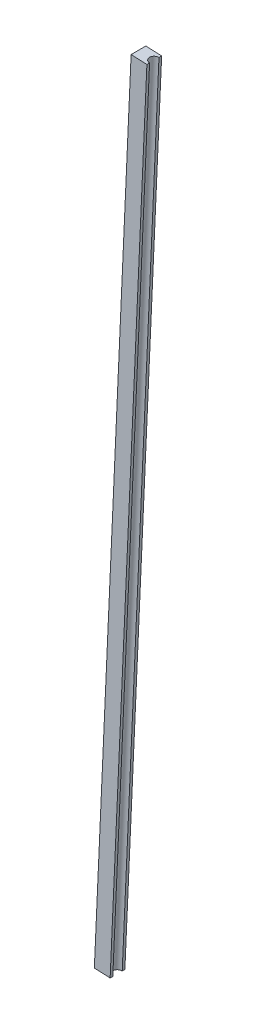
ISO-10303-21;
HEADER;
FILE_DESCRIPTION(('STEP AP214'),'2;1');
FILE_NAME('part.step','',(''),(''),'','','');
FILE_SCHEMA(('AUTOMOTIVE_DESIGN { 1 0 10303 214 1 1 1 1 }'));
ENDSEC;
DATA;
#1=APPLICATION_CONTEXT('core data for automotive mechanical design processes');
#2=APPLICATION_PROTOCOL_DEFINITION('international standard','automotive_design',2000,#1);
#3=PRODUCT_CONTEXT('',#1,'mechanical');
#4=PRODUCT('Part','Part','',(#3));
#5=PRODUCT_RELATED_PRODUCT_CATEGORY('part','',(#4));
#6=PRODUCT_DEFINITION_FORMATION('','',#4);
#7=PRODUCT_DEFINITION_CONTEXT('part definition',#1,'design');
#8=PRODUCT_DEFINITION('design','',#6,#7);
#9=PRODUCT_DEFINITION_SHAPE('','',#8);
#10=(LENGTH_UNIT() NAMED_UNIT(*) SI_UNIT(.MILLI.,.METRE.));
#11=(NAMED_UNIT(*) PLANE_ANGLE_UNIT() SI_UNIT($,.RADIAN.));
#12=(NAMED_UNIT(*) SI_UNIT($,.STERADIAN.) SOLID_ANGLE_UNIT());
#13=UNCERTAINTY_MEASURE_WITH_UNIT(LENGTH_MEASURE(1.E-05),#10,'distance_accuracy_value','');
#14=(GEOMETRIC_REPRESENTATION_CONTEXT(3) GLOBAL_UNCERTAINTY_ASSIGNED_CONTEXT((#13)) GLOBAL_UNIT_ASSIGNED_CONTEXT((#10,
#11,#12)) REPRESENTATION_CONTEXT('',''));
#15=CARTESIAN_POINT('',(0.,0.,0.));
#16=DIRECTION('',(0.,0.,1.));
#17=DIRECTION('',(1.,0.,0.));
#18=AXIS2_PLACEMENT_3D('',#15,#16,#17);
#19=CARTESIAN_POINT('',(22.5216385541284,-528.043182499788,5.74050841179486));
#20=DIRECTION('',(0.998970569790713,-0.0453629881293033,0.));
#21=DIRECTION('',(0.,0.,-1.));
#22=AXIS2_PLACEMENT_3D('',#19,#20,#21);
#23=PLANE('',#22);
#24=DIRECTION('',(0.,0.,-1.));
#25=VECTOR('',#24,1.);
#26=CARTESIAN_POINT('',(34.2742815186662,-269.229887278425,3.12419999999949));
#27=LINE('',#26,#25);
#28=CARTESIAN_POINT('',(34.2742815186638,-269.229887278485,4.5973999999954));
#29=VERTEX_POINT('',#28);
#30=CARTESIAN_POINT('',(34.2742815186662,-269.229887278425,5.4356));
#31=VERTEX_POINT('',#30);
#32=EDGE_CURVE('E68',#29,#31,#27,.F.);
#33=ORIENTED_EDGE('',*,*,#32,.T.);
#34=DIRECTION('',(0.0453629881291976,0.998970569790717,0.));
#35=VECTOR('',#34,1.);
#36=CARTESIAN_POINT('',(28.5131820262568,-396.099149641875,5.4356));
#37=LINE('',#36,#35);
#38=CARTESIAN_POINT('',(22.7520825338394,-522.96841200522,5.4356));
#39=VERTEX_POINT('',#38);
#40=EDGE_CURVE('E93',#31,#39,#37,.F.);
#41=ORIENTED_EDGE('',*,*,#40,.T.);
#42=DIRECTION('',(0.,0.,-1.));
#43=VECTOR('',#42,1.);
#44=CARTESIAN_POINT('',(22.7520825338274,-522.968412005204,5.0165));
#45=LINE('',#44,#43);
#46=CARTESIAN_POINT('',(22.7520825338274,-522.968412005204,4.5974000000046));
#47=VERTEX_POINT('',#46);
#48=EDGE_CURVE('E107',#47,#39,#45,.F.);
#49=ORIENTED_EDGE('',*,*,#48,.F.);
#50=DIRECTION('',(-0.0453629881293033,-0.998970569790713,0.));
#51=VECTOR('',#50,1.);
#52=CARTESIAN_POINT('',(28.5131820262448,-396.099149641874,4.5974));
#53=LINE('',#52,#51);
#54=EDGE_CURVE('E92',#47,#29,#53,.F.);
#55=ORIENTED_EDGE('',*,*,#54,.T.);
#56=EDGE_LOOP('',(#33,#41,#49,#55));
#57=FACE_BOUND('',#56,.T.);
#58=ADVANCED_FACE('F17',(#57),#23,.T.);
#59=CARTESIAN_POINT('',(22.5216385541284,-528.043182499788,1.95590841179588));
#60=DIRECTION('',(0.998970569790713,-0.0453629881293033,0.));
#61=DIRECTION('',(0.,0.,-1.));
#62=AXIS2_PLACEMENT_3D('',#59,#60,#61);
#63=PLANE('',#62);
#64=DIRECTION('',(0.,0.,-1.));
#65=VECTOR('',#64,1.);
#66=CARTESIAN_POINT('',(34.2742815186662,-269.229887278425,3.12419999999949));
#67=LINE('',#66,#65);
#68=CARTESIAN_POINT('',(34.2742815186662,-269.229887278425,0.8128));
#69=VERTEX_POINT('',#68);
#70=CARTESIAN_POINT('',(34.2742815186635,-269.229887278485,1.65099999998619));
#71=VERTEX_POINT('',#70);
#72=EDGE_CURVE('E74',#69,#71,#67,.F.);
#73=ORIENTED_EDGE('',*,*,#72,.T.);
#74=DIRECTION('',(0.0453629881291603,0.998970569790719,0.));
#75=VECTOR('',#74,1.);
#76=CARTESIAN_POINT('',(28.5131820262616,-396.099149641875,1.651));
#77=LINE('',#76,#75);
#78=CARTESIAN_POINT('',(22.7520825338448,-522.968412005205,1.6509999999954));
#79=VERTEX_POINT('',#78);
#80=EDGE_CURVE('E77',#71,#79,#77,.F.);
#81=ORIENTED_EDGE('',*,*,#80,.T.);
#82=DIRECTION('',(0.,0.,-1.));
#83=VECTOR('',#82,1.);
#84=CARTESIAN_POINT('',(22.7520825338274,-522.968412005204,1.2319));
#85=LINE('',#84,#83);
#86=CARTESIAN_POINT('',(22.7520825338248,-522.968412005249,0.8128));
#87=VERTEX_POINT('',#86);
#88=EDGE_CURVE('E82',#87,#79,#85,.F.);
#89=ORIENTED_EDGE('',*,*,#88,.F.);
#90=DIRECTION('',(-0.0453629881291976,-0.998970569790717,0.));
#91=VECTOR('',#90,1.);
#92=CARTESIAN_POINT('',(28.5131820262302,-396.099149641874,0.8128));
#93=LINE('',#92,#91);
#94=EDGE_CURVE('E80',#87,#69,#93,.F.);
#95=ORIENTED_EDGE('',*,*,#94,.T.);
#96=EDGE_LOOP('',(#73,#81,#89,#95));
#97=FACE_BOUND('',#96,.T.);
#98=ADVANCED_FACE('F76',(#97),#63,.T.);
#99=CARTESIAN_POINT('',(29.0217857566172,-268.99137284168,0.507891588204124));
#100=DIRECTION('',(0.0453629881057157,0.998970569791784,0.));
#101=DIRECTION('',(0.,0.,1.));
#102=AXIS2_PLACEMENT_3D('',#99,#100,#101);
#103=PLANE('',#102);
#104=CARTESIAN_POINT('',(34.2742815186384,-269.229887278543,3.12419999998159));
#105=DIRECTION('',(0.0453629881292142,0.998970569790717,0.));
#106=DIRECTION('',(-0.998970569790717,0.0453629881292142,0.));
#107=AXIS2_PLACEMENT_3D('',#104,#105,#106);
#108=CIRCLE('',#107,1.4732000000092);
#109=EDGE_CURVE('E21',#29,#71,#108,.F.);
#110=ORIENTED_EDGE('',*,*,#109,.T.);
#111=ORIENTED_EDGE('',*,*,#72,.F.);
#112=DIRECTION('',(0.998970569791744,-0.04536298810659,0.));
#113=VECTOR('',#112,1.);
#114=CARTESIAN_POINT('',(31.8003309025602,-269.117545838498,0.8128));
#115=LINE('',#114,#113);
#116=CARTESIAN_POINT('',(29.3263802864797,-269.005204398365,0.8128));
#117=VERTEX_POINT('',#116);
#118=EDGE_CURVE('E118',#69,#117,#115,.F.);
#119=ORIENTED_EDGE('',*,*,#118,.T.);
#120=DIRECTION('',(0.,0.,-1.));
#121=VECTOR('',#120,1.);
#122=CARTESIAN_POINT('',(29.3263802864689,-269.005204398217,3.12419999999949));
#123=LINE('',#122,#121);
#124=CARTESIAN_POINT('',(29.3263802864838,-269.005204398278,5.4356));
#125=VERTEX_POINT('',#124);
#126=EDGE_CURVE('E137',#117,#125,#123,.F.);
#127=ORIENTED_EDGE('',*,*,#126,.T.);
#128=DIRECTION('',(-0.998970569791744,0.04536298810659,0.));
#129=VECTOR('',#128,1.);
#130=CARTESIAN_POINT('',(31.8003309025709,-269.117545838263,5.4356));
#131=LINE('',#130,#129);
#132=EDGE_CURVE('E97',#125,#31,#131,.F.);
#133=ORIENTED_EDGE('',*,*,#132,.T.);
#134=ORIENTED_EDGE('',*,*,#32,.F.);
#135=EDGE_LOOP('',(#110,#111,#119,#127,#133,#134));
#136=FACE_BOUND('',#135,.T.);
#137=ADVANCED_FACE('F91',(#136),#103,.T.);
#138=CARTESIAN_POINT('',(17.2691427920898,-527.804668062924,5.4356));
#139=DIRECTION('',(0.,0.,1.));
#140=DIRECTION('',(0.99897056978972,-0.0453629881511621,0.));
#141=AXIS2_PLACEMENT_3D('',#138,#139,#140);
#142=PLANE('',#141);
#143=ORIENTED_EDGE('',*,*,#132,.F.);
#144=DIRECTION('',(0.0453629881291734,0.998970569790718,0.));
#145=VECTOR('',#144,1.);
#146=CARTESIAN_POINT('',(23.5652807940622,-395.874466761675,5.4356));
#147=LINE('',#146,#145);
#148=CARTESIAN_POINT('',(17.80418130166,-522.743729124984,5.4356));
#149=VERTEX_POINT('',#148);
#150=EDGE_CURVE('E132',#125,#149,#147,.F.);
#151=ORIENTED_EDGE('',*,*,#150,.T.);
#152=DIRECTION('',(0.998970569789721,-0.0453629881511429,0.));
#153=VECTOR('',#152,1.);
#154=CARTESIAN_POINT('',(20.2781319177394,-522.856070565168,5.4356));
#155=LINE('',#154,#153);
#156=EDGE_CURVE('E129',#149,#39,#155,.T.);
#157=ORIENTED_EDGE('',*,*,#156,.T.);
#158=ORIENTED_EDGE('',*,*,#40,.F.);
#159=EDGE_LOOP('',(#143,#151,#157,#158));
#160=FACE_BOUND('',#159,.T.);
#161=ADVANCED_FACE('F147',(#160),#142,.T.);
#162=CARTESIAN_POINT('',(22.7520825338262,-522.968412005205,3.1242));
#163=DIRECTION('',(0.0453629881292142,0.998970569790717,0.));
#164=DIRECTION('',(-0.998970569790717,0.0453629881292142,0.));
#165=AXIS2_PLACEMENT_3D('',#162,#163,#164);
#166=CYLINDRICAL_SURFACE('',#165,1.4732000000092);
#167=ORIENTED_EDGE('',*,*,#109,.F.);
#168=ORIENTED_EDGE('',*,*,#54,.F.);
#169=CARTESIAN_POINT('',(22.7520825338262,-522.968412005204,3.1242));
#170=DIRECTION('',(0.0453629881292142,0.998970569790717,0.));
#171=DIRECTION('',(-0.998970569790717,0.0453629881292142,0.));
#172=AXIS2_PLACEMENT_3D('',#169,#170,#171);
#173=CIRCLE('',#172,1.4732000000092);
#174=EDGE_CURVE('E89',#47,#79,#173,.F.);
#175=ORIENTED_EDGE('',*,*,#174,.T.);
#176=ORIENTED_EDGE('',*,*,#80,.F.);
#177=EDGE_LOOP('',(#167,#168,#175,#176));
#178=FACE_BOUND('',#177,.T.);
#179=ADVANCED_FACE('F85',(#178),#166,.F.);
#180=CARTESIAN_POINT('',(22.8262330839957,-528.05701405658,0.8128));
#181=DIRECTION('',(0.,0.,-1.));
#182=DIRECTION('',(-0.99897056978972,0.0453629881511621,0.));
#183=AXIS2_PLACEMENT_3D('',#180,#181,#182);
#184=PLANE('',#183);
#185=ORIENTED_EDGE('',*,*,#118,.F.);
#186=ORIENTED_EDGE('',*,*,#94,.F.);
#187=DIRECTION('',(-0.998970569789721,0.0453629881511429,0.));
#188=VECTOR('',#187,1.);
#189=CARTESIAN_POINT('',(20.2781319177394,-522.856070565168,0.8128));
#190=LINE('',#189,#188);
#191=CARTESIAN_POINT('',(17.8041813016544,-522.743729125102,0.8128));
#192=VERTEX_POINT('',#191);
#193=EDGE_CURVE('E27',#87,#192,#190,.T.);
#194=ORIENTED_EDGE('',*,*,#193,.T.);
#195=DIRECTION('',(-0.0453629881291734,-0.998970569790718,0.));
#196=VECTOR('',#195,1.);
#197=CARTESIAN_POINT('',(23.5652807940622,-395.874466761675,0.8128));
#198=LINE('',#197,#196);
#199=EDGE_CURVE('E35',#192,#117,#198,.F.);
#200=ORIENTED_EDGE('',*,*,#199,.T.);
#201=EDGE_LOOP('',(#185,#186,#194,#200));
#202=FACE_BOUND('',#201,.T.);
#203=ADVANCED_FACE('F143',(#202),#184,.T.);
#204=CARTESIAN_POINT('',(17.5737373219572,-527.818499619716,0.507891588204124));
#205=DIRECTION('',(-0.998970569790719,0.0453629881291734,0.));
#206=DIRECTION('',(0.,0.,1.));
#207=AXIS2_PLACEMENT_3D('',#204,#205,#206);
#208=PLANE('',#207);
#209=ORIENTED_EDGE('',*,*,#126,.F.);
#210=ORIENTED_EDGE('',*,*,#199,.F.);
#211=DIRECTION('',(0.,0.,1.));
#212=VECTOR('',#211,1.);
#213=CARTESIAN_POINT('',(17.804181301658,-522.743729125012,3.12419999999949));
#214=LINE('',#213,#212);
#215=EDGE_CURVE('E11',#192,#149,#214,.T.);
#216=ORIENTED_EDGE('',*,*,#215,.T.);
#217=ORIENTED_EDGE('',*,*,#150,.F.);
#218=EDGE_LOOP('',(#209,#210,#216,#217));
#219=FACE_BOUND('',#218,.T.);
#220=ADVANCED_FACE('F146',(#219),#208,.T.);
#221=CARTESIAN_POINT('',(17.4995867717877,-522.72989756834,0.507891588204124));
#222=DIRECTION('',(0.0453629881511429,0.998970569789721,0.));
#223=DIRECTION('',(0.,0.,1.));
#224=AXIS2_PLACEMENT_3D('',#221,#222,#223);
#225=PLANE('',#224);
#226=ORIENTED_EDGE('',*,*,#193,.F.);
#227=ORIENTED_EDGE('',*,*,#88,.T.);
#228=ORIENTED_EDGE('',*,*,#174,.F.);
#229=ORIENTED_EDGE('',*,*,#48,.T.);
#230=ORIENTED_EDGE('',*,*,#156,.F.);
#231=ORIENTED_EDGE('',*,*,#215,.F.);
#232=EDGE_LOOP('',(#226,#227,#228,#229,#230,#231));
#233=FACE_BOUND('',#232,.T.);
#234=ADVANCED_FACE('F19',(#233),#225,.F.);
#235=CLOSED_SHELL('',(#58,#98,#137,#161,#179,#203,#220,#234));
#236=MANIFOLD_SOLID_BREP('B1',#235);
#237=ADVANCED_BREP_SHAPE_REPRESENTATION('',(#18,#236),#14);
#238=SHAPE_DEFINITION_REPRESENTATION(#9,#237);
ENDSEC;
END-ISO-10303-21;
